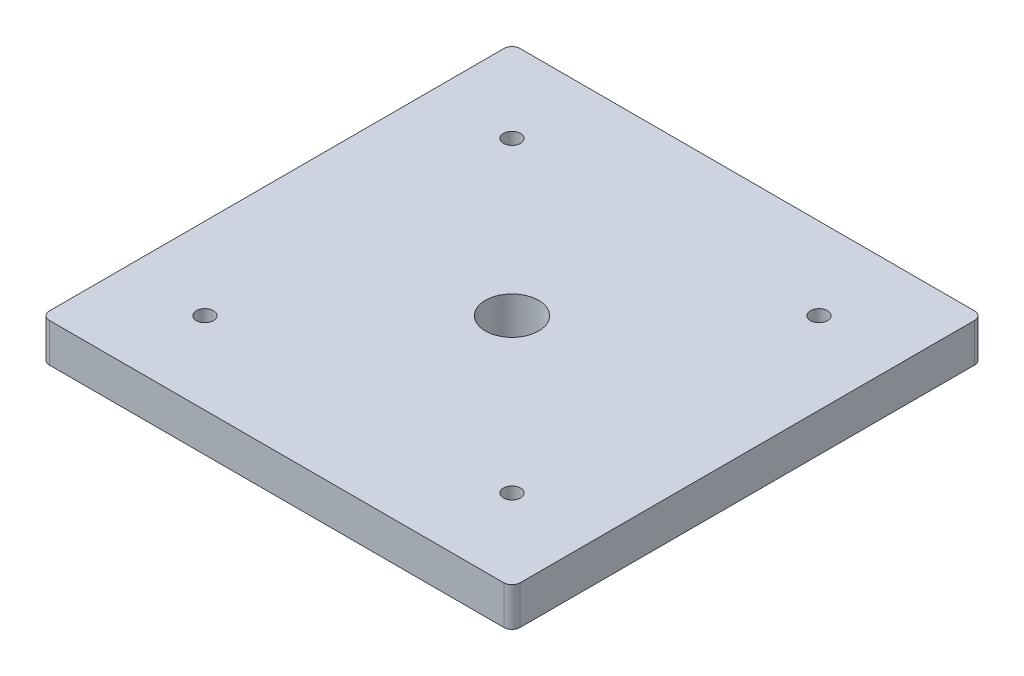
ISO-10303-21;
HEADER;
FILE_DESCRIPTION(('STEP AP214'),'2;1');
FILE_NAME('part.step','',(''),(''),'','','');
FILE_SCHEMA(('AUTOMOTIVE_DESIGN { 1 0 10303 214 1 1 1 1 }'));
ENDSEC;
DATA;
#1=APPLICATION_CONTEXT('core data for automotive mechanical design processes');
#2=APPLICATION_PROTOCOL_DEFINITION('international standard','automotive_design',2000,#1);
#3=PRODUCT_CONTEXT('',#1,'mechanical');
#4=PRODUCT('Part','Part','',(#3));
#5=PRODUCT_RELATED_PRODUCT_CATEGORY('part','',(#4));
#6=PRODUCT_DEFINITION_FORMATION('','',#4);
#7=PRODUCT_DEFINITION_CONTEXT('part definition',#1,'design');
#8=PRODUCT_DEFINITION('design','',#6,#7);
#9=PRODUCT_DEFINITION_SHAPE('','',#8);
#10=(LENGTH_UNIT() NAMED_UNIT(*) SI_UNIT(.MILLI.,.METRE.));
#11=(NAMED_UNIT(*) PLANE_ANGLE_UNIT() SI_UNIT($,.RADIAN.));
#12=(NAMED_UNIT(*) SI_UNIT($,.STERADIAN.) SOLID_ANGLE_UNIT());
#13=UNCERTAINTY_MEASURE_WITH_UNIT(LENGTH_MEASURE(1.E-05),#10,'distance_accuracy_value','');
#14=(GEOMETRIC_REPRESENTATION_CONTEXT(3) GLOBAL_UNCERTAINTY_ASSIGNED_CONTEXT((#13)) GLOBAL_UNIT_ASSIGNED_CONTEXT((#10,
#11,#12)) REPRESENTATION_CONTEXT('',''));
#15=CARTESIAN_POINT('',(0.,0.,0.));
#16=DIRECTION('',(0.,0.,1.));
#17=DIRECTION('',(1.,0.,0.));
#18=AXIS2_PLACEMENT_3D('',#15,#16,#17);
#19=CARTESIAN_POINT('',(-47.6250000000001,5.460000002,-47.6250000000001));
#20=DIRECTION('',(0.,-1.,0.));
#21=DIRECTION('',(0.,0.,-1.));
#22=AXIS2_PLACEMENT_3D('',#19,#20,#21);
#23=CYLINDRICAL_SURFACE('',#22,7.9375);
#24=CARTESIAN_POINT('',(-47.6250000000001,5.460000002,-47.6250000000001));
#25=DIRECTION('',(0.,-1.,0.));
#26=DIRECTION('',(0.,0.,-1.));
#27=AXIS2_PLACEMENT_3D('',#24,#25,#26);
#28=CIRCLE('',#27,7.9375);
#29=CARTESIAN_POINT('',(-47.6250000000001,5.460000002,-55.5625000000001));
#30=VERTEX_POINT('',#29);
#31=EDGE_CURVE('E179',#30,#30,#28,.T.);
#32=ORIENTED_EDGE('',*,*,#31,.F.);
#33=EDGE_LOOP('',(#32));
#34=FACE_BOUND('',#33,.T.);
#35=CARTESIAN_POINT('',(-47.6250000000001,0.,-47.6250000000001));
#36=DIRECTION('',(0.,-1.,0.));
#37=DIRECTION('',(0.,0.,-1.));
#38=AXIS2_PLACEMENT_3D('',#35,#36,#37);
#39=CIRCLE('',#38,7.9375);
#40=CARTESIAN_POINT('',(-47.6250000000001,0.,-55.5625000000001));
#41=VERTEX_POINT('',#40);
#42=EDGE_CURVE('E176',#41,#41,#39,.T.);
#43=ORIENTED_EDGE('',*,*,#42,.T.);
#44=EDGE_LOOP('',(#43));
#45=FACE_BOUND('',#44,.T.);
#46=ADVANCED_FACE('F16',(#34,#45),#23,.F.);
#47=CARTESIAN_POINT('',(47.6249999999999,5.460000002,-47.6250000000001));
#48=DIRECTION('',(0.,-1.,0.));
#49=DIRECTION('',(0.,0.,-1.));
#50=AXIS2_PLACEMENT_3D('',#47,#48,#49);
#51=CYLINDRICAL_SURFACE('',#50,7.9375);
#52=CARTESIAN_POINT('',(47.6249999999999,5.460000002,-47.6250000000001));
#53=DIRECTION('',(0.,-1.,0.));
#54=DIRECTION('',(0.,0.,-1.));
#55=AXIS2_PLACEMENT_3D('',#52,#53,#54);
#56=CIRCLE('',#55,7.9375);
#57=CARTESIAN_POINT('',(47.6249999999999,5.460000002,-55.5625000000001));
#58=VERTEX_POINT('',#57);
#59=EDGE_CURVE('E182',#58,#58,#56,.T.);
#60=ORIENTED_EDGE('',*,*,#59,.F.);
#61=EDGE_LOOP('',(#60));
#62=FACE_BOUND('',#61,.T.);
#63=CARTESIAN_POINT('',(47.6249999999999,0.,-47.6250000000001));
#64=DIRECTION('',(0.,-1.,0.));
#65=DIRECTION('',(0.,0.,-1.));
#66=AXIS2_PLACEMENT_3D('',#63,#64,#65);
#67=CIRCLE('',#66,7.9375);
#68=CARTESIAN_POINT('',(47.6249999999999,0.,-55.5625000000001));
#69=VERTEX_POINT('',#68);
#70=EDGE_CURVE('E173',#69,#69,#67,.T.);
#71=ORIENTED_EDGE('',*,*,#70,.T.);
#72=EDGE_LOOP('',(#71));
#73=FACE_BOUND('',#72,.T.);
#74=ADVANCED_FACE('F212',(#62,#73),#51,.F.);
#75=CARTESIAN_POINT('',(47.625,5.460000002,47.6249999999999));
#76=DIRECTION('',(0.,-1.,0.));
#77=DIRECTION('',(0.,0.,-1.));
#78=AXIS2_PLACEMENT_3D('',#75,#76,#77);
#79=CYLINDRICAL_SURFACE('',#78,7.9375);
#80=CARTESIAN_POINT('',(47.625,5.460000002,47.6249999999999));
#81=DIRECTION('',(0.,-1.,0.));
#82=DIRECTION('',(0.,0.,-1.));
#83=AXIS2_PLACEMENT_3D('',#80,#81,#82);
#84=CIRCLE('',#83,7.9375);
#85=CARTESIAN_POINT('',(47.625,5.460000002,39.6874999999999));
#86=VERTEX_POINT('',#85);
#87=EDGE_CURVE('E184',#86,#86,#84,.T.);
#88=ORIENTED_EDGE('',*,*,#87,.F.);
#89=EDGE_LOOP('',(#88));
#90=FACE_BOUND('',#89,.T.);
#91=CARTESIAN_POINT('',(47.625,0.,47.6249999999999));
#92=DIRECTION('',(0.,-1.,0.));
#93=DIRECTION('',(0.,0.,-1.));
#94=AXIS2_PLACEMENT_3D('',#91,#92,#93);
#95=CIRCLE('',#94,7.9375);
#96=CARTESIAN_POINT('',(47.625,0.,39.6874999999999));
#97=VERTEX_POINT('',#96);
#98=EDGE_CURVE('E170',#97,#97,#95,.T.);
#99=ORIENTED_EDGE('',*,*,#98,.T.);
#100=EDGE_LOOP('',(#99));
#101=FACE_BOUND('',#100,.T.);
#102=ADVANCED_FACE('F196',(#90,#101),#79,.F.);
#103=CARTESIAN_POINT('',(-47.625,5.460000002,47.6249999999999));
#104=DIRECTION('',(0.,-1.,0.));
#105=DIRECTION('',(0.,0.,-1.));
#106=AXIS2_PLACEMENT_3D('',#103,#104,#105);
#107=CYLINDRICAL_SURFACE('',#106,7.9375);
#108=CARTESIAN_POINT('',(-47.625,5.460000002,47.6249999999999));
#109=DIRECTION('',(0.,-1.,0.));
#110=DIRECTION('',(0.,0.,-1.));
#111=AXIS2_PLACEMENT_3D('',#108,#109,#110);
#112=CIRCLE('',#111,7.9375);
#113=CARTESIAN_POINT('',(-47.625,5.460000002,39.6874999999999));
#114=VERTEX_POINT('',#113);
#115=EDGE_CURVE('E19',#114,#114,#112,.T.);
#116=ORIENTED_EDGE('',*,*,#115,.F.);
#117=EDGE_LOOP('',(#116));
#118=FACE_BOUND('',#117,.T.);
#119=CARTESIAN_POINT('',(-47.625,0.,47.6249999999999));
#120=DIRECTION('',(0.,-1.,0.));
#121=DIRECTION('',(0.,0.,-1.));
#122=AXIS2_PLACEMENT_3D('',#119,#120,#121);
#123=CIRCLE('',#122,7.9375);
#124=CARTESIAN_POINT('',(-47.625,0.,39.6874999999999));
#125=VERTEX_POINT('',#124);
#126=EDGE_CURVE('E167',#125,#125,#123,.T.);
#127=ORIENTED_EDGE('',*,*,#126,.T.);
#128=EDGE_LOOP('',(#127));
#129=FACE_BOUND('',#128,.T.);
#130=ADVANCED_FACE('F193',(#118,#129),#107,.F.);
#131=CARTESIAN_POINT('',(-47.625,5.460000002,47.6249999999999));
#132=DIRECTION('',(0.,-1.,0.));
#133=DIRECTION('',(0.,0.,-1.));
#134=AXIS2_PLACEMENT_3D('',#131,#132,#133);
#135=PLANE('',#134);
#136=CARTESIAN_POINT('',(-47.625,5.460000002,47.6249999999999));
#137=DIRECTION('',(0.,-1.,0.));
#138=DIRECTION('',(0.,0.,-1.));
#139=AXIS2_PLACEMENT_3D('',#136,#137,#138);
#140=CIRCLE('',#139,2.667);
#141=CARTESIAN_POINT('',(-47.625,5.460000002,44.9579999999999));
#142=VERTEX_POINT('',#141);
#143=EDGE_CURVE('E164',#142,#142,#140,.F.);
#144=ORIENTED_EDGE('',*,*,#143,.T.);
#145=EDGE_LOOP('',(#144));
#146=FACE_BOUND('',#145,.T.);
#147=ORIENTED_EDGE('',*,*,#115,.T.);
#148=EDGE_LOOP('',(#147));
#149=FACE_BOUND('',#148,.T.);
#150=ADVANCED_FACE('F191',(#146,#149),#135,.T.);
#151=CARTESIAN_POINT('',(47.625,5.460000002,47.6249999999999));
#152=DIRECTION('',(0.,-1.,0.));
#153=DIRECTION('',(0.,0.,-1.));
#154=AXIS2_PLACEMENT_3D('',#151,#152,#153);
#155=PLANE('',#154);
#156=CARTESIAN_POINT('',(47.625,5.460000002,47.6249999999999));
#157=DIRECTION('',(0.,-1.,0.));
#158=DIRECTION('',(0.,0.,-1.));
#159=AXIS2_PLACEMENT_3D('',#156,#157,#158);
#160=CIRCLE('',#159,2.667);
#161=CARTESIAN_POINT('',(47.625,5.460000002,44.9579999999999));
#162=VERTEX_POINT('',#161);
#163=EDGE_CURVE('E161',#162,#162,#160,.F.);
#164=ORIENTED_EDGE('',*,*,#163,.T.);
#165=EDGE_LOOP('',(#164));
#166=FACE_BOUND('',#165,.T.);
#167=ORIENTED_EDGE('',*,*,#87,.T.);
#168=EDGE_LOOP('',(#167));
#169=FACE_BOUND('',#168,.T.);
#170=ADVANCED_FACE('F280',(#166,#169),#155,.T.);
#171=CARTESIAN_POINT('',(47.6249999999999,5.460000002,-47.6250000000001));
#172=DIRECTION('',(0.,-1.,0.));
#173=DIRECTION('',(0.,0.,-1.));
#174=AXIS2_PLACEMENT_3D('',#171,#172,#173);
#175=PLANE('',#174);
#176=CARTESIAN_POINT('',(47.6249999999999,5.460000002,-47.6250000000001));
#177=DIRECTION('',(0.,-1.,0.));
#178=DIRECTION('',(0.,0.,-1.));
#179=AXIS2_PLACEMENT_3D('',#176,#177,#178);
#180=CIRCLE('',#179,2.667);
#181=CARTESIAN_POINT('',(47.6249999999999,5.460000002,-50.2920000000001));
#182=VERTEX_POINT('',#181);
#183=EDGE_CURVE('E158',#182,#182,#180,.F.);
#184=ORIENTED_EDGE('',*,*,#183,.T.);
#185=EDGE_LOOP('',(#184));
#186=FACE_BOUND('',#185,.T.);
#187=ORIENTED_EDGE('',*,*,#59,.T.);
#188=EDGE_LOOP('',(#187));
#189=FACE_BOUND('',#188,.T.);
#190=ADVANCED_FACE('F276',(#186,#189),#175,.T.);
#191=CARTESIAN_POINT('',(-47.6250000000001,5.460000002,-47.6250000000001));
#192=DIRECTION('',(0.,-1.,0.));
#193=DIRECTION('',(0.,0.,-1.));
#194=AXIS2_PLACEMENT_3D('',#191,#192,#193);
#195=PLANE('',#194);
#196=CARTESIAN_POINT('',(-47.6250000000001,5.460000002,-47.6250000000001));
#197=DIRECTION('',(0.,-1.,0.));
#198=DIRECTION('',(0.,0.,-1.));
#199=AXIS2_PLACEMENT_3D('',#196,#197,#198);
#200=CIRCLE('',#199,2.667);
#201=CARTESIAN_POINT('',(-47.6250000000001,5.460000002,-50.2920000000001));
#202=VERTEX_POINT('',#201);
#203=EDGE_CURVE('E112',#202,#202,#200,.F.);
#204=ORIENTED_EDGE('',*,*,#203,.T.);
#205=EDGE_LOOP('',(#204));
#206=FACE_BOUND('',#205,.T.);
#207=ORIENTED_EDGE('',*,*,#31,.T.);
#208=EDGE_LOOP('',(#207));
#209=FACE_BOUND('',#208,.T.);
#210=ADVANCED_FACE('F202',(#206,#209),#195,.T.);
#211=CARTESIAN_POINT('',(0.,0.,0.));
#212=DIRECTION('',(0.,1.,0.));
#213=DIRECTION('',(0.,0.,1.));
#214=AXIS2_PLACEMENT_3D('',#211,#212,#213);
#215=PLANE('',#214);
#216=CARTESIAN_POINT('',(0.,0.,0.));
#217=DIRECTION('',(0.,-1.,0.));
#218=DIRECTION('',(0.,0.,-1.));
#219=AXIS2_PLACEMENT_3D('',#216,#217,#218);
#220=CIRCLE('',#219,8.255);
#221=CARTESIAN_POINT('',(0.,0.,-8.255));
#222=VERTEX_POINT('',#221);
#223=EDGE_CURVE('E145',#222,#222,#220,.F.);
#224=ORIENTED_EDGE('',*,*,#223,.T.);
#225=EDGE_LOOP('',(#224));
#226=FACE_BOUND('',#225,.T.);
#227=CARTESIAN_POINT('',(-70.485,0.,-70.485));
#228=DIRECTION('',(0.,-1.,0.));
#229=DIRECTION('',(0.,0.,-1.));
#230=AXIS2_PLACEMENT_3D('',#227,#228,#229);
#231=CIRCLE('',#230,2.54);
#232=CARTESIAN_POINT('',(-70.485,0.,-73.025));
#233=VERTEX_POINT('',#232);
#234=CARTESIAN_POINT('',(-73.025,0.,-70.485));
#235=VERTEX_POINT('',#234);
#236=EDGE_CURVE('E86',#233,#235,#231,.F.);
#237=ORIENTED_EDGE('',*,*,#236,.F.);
#238=DIRECTION('',(1.,0.,0.));
#239=VECTOR('',#238,1.);
#240=CARTESIAN_POINT('',(73.025,0.,-73.025));
#241=LINE('',#240,#239);
#242=CARTESIAN_POINT('',(70.485,0.,-73.025));
#243=VERTEX_POINT('',#242);
#244=EDGE_CURVE('E77',#233,#243,#241,.T.);
#245=ORIENTED_EDGE('',*,*,#244,.T.);
#246=CARTESIAN_POINT('',(70.485,0.,-70.485));
#247=DIRECTION('',(0.,-1.,0.));
#248=DIRECTION('',(0.,0.,-1.));
#249=AXIS2_PLACEMENT_3D('',#246,#247,#248);
#250=CIRCLE('',#249,2.54);
#251=CARTESIAN_POINT('',(73.025,0.,-70.485));
#252=VERTEX_POINT('',#251);
#253=EDGE_CURVE('E149',#252,#243,#250,.F.);
#254=ORIENTED_EDGE('',*,*,#253,.F.);
#255=DIRECTION('',(0.,0.,1.));
#256=VECTOR('',#255,1.);
#257=CARTESIAN_POINT('',(73.025,0.,73.025));
#258=LINE('',#257,#256);
#259=CARTESIAN_POINT('',(73.025,0.,70.485));
#260=VERTEX_POINT('',#259);
#261=EDGE_CURVE('E113',#252,#260,#258,.T.);
#262=ORIENTED_EDGE('',*,*,#261,.T.);
#263=CARTESIAN_POINT('',(70.485,0.,70.485));
#264=DIRECTION('',(0.,-1.,0.));
#265=DIRECTION('',(0.,0.,-1.));
#266=AXIS2_PLACEMENT_3D('',#263,#264,#265);
#267=CIRCLE('',#266,2.54);
#268=CARTESIAN_POINT('',(70.485,0.,73.025));
#269=VERTEX_POINT('',#268);
#270=EDGE_CURVE('E152',#269,#260,#267,.F.);
#271=ORIENTED_EDGE('',*,*,#270,.F.);
#272=DIRECTION('',(-1.,0.,0.));
#273=VECTOR('',#272,1.);
#274=CARTESIAN_POINT('',(73.025,0.,73.025));
#275=LINE('',#274,#273);
#276=CARTESIAN_POINT('',(-70.485,0.,73.025));
#277=VERTEX_POINT('',#276);
#278=EDGE_CURVE('E117',#269,#277,#275,.T.);
#279=ORIENTED_EDGE('',*,*,#278,.T.);
#280=CARTESIAN_POINT('',(-70.485,0.,70.485));
#281=DIRECTION('',(0.,-1.,0.));
#282=DIRECTION('',(0.,0.,-1.));
#283=AXIS2_PLACEMENT_3D('',#280,#281,#282);
#284=CIRCLE('',#283,2.54);
#285=CARTESIAN_POINT('',(-73.025,0.,70.485));
#286=VERTEX_POINT('',#285);
#287=EDGE_CURVE('E89',#286,#277,#284,.F.);
#288=ORIENTED_EDGE('',*,*,#287,.F.);
#289=DIRECTION('',(0.,0.,-1.));
#290=VECTOR('',#289,1.);
#291=CARTESIAN_POINT('',(-73.025,0.,73.025));
#292=LINE('',#291,#290);
#293=EDGE_CURVE('E82',#286,#235,#292,.T.);
#294=ORIENTED_EDGE('',*,*,#293,.T.);
#295=EDGE_LOOP('',(#237,#245,#254,#262,#271,#279,#288,#294));
#296=FACE_BOUND('',#295,.T.);
#297=ORIENTED_EDGE('',*,*,#126,.F.);
#298=EDGE_LOOP('',(#297));
#299=FACE_BOUND('',#298,.T.);
#300=ORIENTED_EDGE('',*,*,#98,.F.);
#301=EDGE_LOOP('',(#300));
#302=FACE_BOUND('',#301,.T.);
#303=ORIENTED_EDGE('',*,*,#70,.F.);
#304=EDGE_LOOP('',(#303));
#305=FACE_BOUND('',#304,.T.);
#306=ORIENTED_EDGE('',*,*,#42,.F.);
#307=EDGE_LOOP('',(#306));
#308=FACE_BOUND('',#307,.T.);
#309=ADVANCED_FACE('F84',(#226,#296,#299,#302,#305,#308),#215,.F.);
#310=CARTESIAN_POINT('',(-47.625,12.,47.6249999999999));
#311=DIRECTION('',(0.,-1.,0.));
#312=DIRECTION('',(0.,0.,-1.));
#313=AXIS2_PLACEMENT_3D('',#310,#311,#312);
#314=CYLINDRICAL_SURFACE('',#313,2.667);
#315=ORIENTED_EDGE('',*,*,#143,.F.);
#316=EDGE_LOOP('',(#315));
#317=FACE_BOUND('',#316,.T.);
#318=CARTESIAN_POINT('',(-47.625,12.,47.6249999999999));
#319=DIRECTION('',(0.,-1.,0.));
#320=DIRECTION('',(0.,0.,-1.));
#321=AXIS2_PLACEMENT_3D('',#318,#319,#320);
#322=CIRCLE('',#321,2.667);
#323=CARTESIAN_POINT('',(-47.625,12.,44.9579999999999));
#324=VERTEX_POINT('',#323);
#325=EDGE_CURVE('E142',#324,#324,#322,.T.);
#326=ORIENTED_EDGE('',*,*,#325,.F.);
#327=EDGE_LOOP('',(#326));
#328=FACE_BOUND('',#327,.T.);
#329=ADVANCED_FACE('F201',(#317,#328),#314,.F.);
#330=CARTESIAN_POINT('',(47.625,12.,47.6249999999999));
#331=DIRECTION('',(0.,-1.,0.));
#332=DIRECTION('',(0.,0.,-1.));
#333=AXIS2_PLACEMENT_3D('',#330,#331,#332);
#334=CYLINDRICAL_SURFACE('',#333,2.667);
#335=ORIENTED_EDGE('',*,*,#163,.F.);
#336=EDGE_LOOP('',(#335));
#337=FACE_BOUND('',#336,.T.);
#338=CARTESIAN_POINT('',(47.625,12.,47.6249999999999));
#339=DIRECTION('',(0.,-1.,0.));
#340=DIRECTION('',(0.,0.,-1.));
#341=AXIS2_PLACEMENT_3D('',#338,#339,#340);
#342=CIRCLE('',#341,2.667);
#343=CARTESIAN_POINT('',(47.625,12.,44.9579999999999));
#344=VERTEX_POINT('',#343);
#345=EDGE_CURVE('E139',#344,#344,#342,.T.);
#346=ORIENTED_EDGE('',*,*,#345,.F.);
#347=EDGE_LOOP('',(#346));
#348=FACE_BOUND('',#347,.T.);
#349=ADVANCED_FACE('F266',(#337,#348),#334,.F.);
#350=CARTESIAN_POINT('',(47.6249999999999,12.,-47.6250000000001));
#351=DIRECTION('',(0.,-1.,0.));
#352=DIRECTION('',(0.,0.,-1.));
#353=AXIS2_PLACEMENT_3D('',#350,#351,#352);
#354=CYLINDRICAL_SURFACE('',#353,2.667);
#355=ORIENTED_EDGE('',*,*,#183,.F.);
#356=EDGE_LOOP('',(#355));
#357=FACE_BOUND('',#356,.T.);
#358=CARTESIAN_POINT('',(47.6249999999999,12.,-47.6250000000001));
#359=DIRECTION('',(0.,-1.,0.));
#360=DIRECTION('',(0.,0.,-1.));
#361=AXIS2_PLACEMENT_3D('',#358,#359,#360);
#362=CIRCLE('',#361,2.667);
#363=CARTESIAN_POINT('',(47.6249999999999,12.,-50.2920000000001));
#364=VERTEX_POINT('',#363);
#365=EDGE_CURVE('E136',#364,#364,#362,.T.);
#366=ORIENTED_EDGE('',*,*,#365,.F.);
#367=EDGE_LOOP('',(#366));
#368=FACE_BOUND('',#367,.T.);
#369=ADVANCED_FACE('F262',(#357,#368),#354,.F.);
#370=CARTESIAN_POINT('',(-47.6250000000001,12.,-47.6250000000001));
#371=DIRECTION('',(0.,-1.,0.));
#372=DIRECTION('',(0.,0.,-1.));
#373=AXIS2_PLACEMENT_3D('',#370,#371,#372);
#374=CYLINDRICAL_SURFACE('',#373,2.667);
#375=ORIENTED_EDGE('',*,*,#203,.F.);
#376=EDGE_LOOP('',(#375));
#377=FACE_BOUND('',#376,.T.);
#378=CARTESIAN_POINT('',(-47.6250000000001,12.,-47.6250000000001));
#379=DIRECTION('',(0.,-1.,0.));
#380=DIRECTION('',(0.,0.,-1.));
#381=AXIS2_PLACEMENT_3D('',#378,#379,#380);
#382=CIRCLE('',#381,2.667);
#383=CARTESIAN_POINT('',(-47.6250000000001,12.,-50.2920000000001));
#384=VERTEX_POINT('',#383);
#385=EDGE_CURVE('E133',#384,#384,#382,.T.);
#386=ORIENTED_EDGE('',*,*,#385,.F.);
#387=EDGE_LOOP('',(#386));
#388=FACE_BOUND('',#387,.T.);
#389=ADVANCED_FACE('F259',(#377,#388),#374,.F.);
#390=CARTESIAN_POINT('',(73.025,12.,-73.025));
#391=DIRECTION('',(0.,0.,1.));
#392=DIRECTION('',(1.,0.,0.));
#393=AXIS2_PLACEMENT_3D('',#390,#391,#392);
#394=PLANE('',#393);
#395=DIRECTION('',(0.,-1.,0.));
#396=VECTOR('',#395,1.);
#397=CARTESIAN_POINT('',(-70.485,12.,-73.025));
#398=LINE('',#397,#396);
#399=CARTESIAN_POINT('',(-70.485,12.,-73.025));
#400=VERTEX_POINT('',#399);
#401=EDGE_CURVE('E99',#400,#233,#398,.T.);
#402=ORIENTED_EDGE('',*,*,#401,.F.);
#403=DIRECTION('',(1.,0.,0.));
#404=VECTOR('',#403,1.);
#405=CARTESIAN_POINT('',(0.,12.,-73.025));
#406=LINE('',#405,#404);
#407=CARTESIAN_POINT('',(70.485,12.,-73.025));
#408=VERTEX_POINT('',#407);
#409=EDGE_CURVE('E132',#408,#400,#406,.F.);
#410=ORIENTED_EDGE('',*,*,#409,.F.);
#411=DIRECTION('',(0.,-1.,0.));
#412=VECTOR('',#411,1.);
#413=CARTESIAN_POINT('',(70.485,12.,-73.025));
#414=LINE('',#413,#412);
#415=EDGE_CURVE('E148',#243,#408,#414,.F.);
#416=ORIENTED_EDGE('',*,*,#415,.F.);
#417=ORIENTED_EDGE('',*,*,#244,.F.);
#418=EDGE_LOOP('',(#402,#410,#416,#417));
#419=FACE_BOUND('',#418,.T.);
#420=ADVANCED_FACE('F256',(#419),#394,.F.);
#421=CARTESIAN_POINT('',(-70.485,12.,-70.485));
#422=DIRECTION('',(0.,-1.,0.));
#423=DIRECTION('',(0.,0.,-1.));
#424=AXIS2_PLACEMENT_3D('',#421,#422,#423);
#425=CYLINDRICAL_SURFACE('',#424,2.54);
#426=ORIENTED_EDGE('',*,*,#236,.T.);
#427=DIRECTION('',(0.,1.,0.));
#428=VECTOR('',#427,1.);
#429=CARTESIAN_POINT('',(-73.025,12.,-70.485));
#430=LINE('',#429,#428);
#431=CARTESIAN_POINT('',(-73.025,12.,-70.485));
#432=VERTEX_POINT('',#431);
#433=EDGE_CURVE('E93',#235,#432,#430,.T.);
#434=ORIENTED_EDGE('',*,*,#433,.T.);
#435=CARTESIAN_POINT('',(-70.485,12.,-70.485));
#436=DIRECTION('',(0.,-1.,0.));
#437=DIRECTION('',(0.,0.,-1.));
#438=AXIS2_PLACEMENT_3D('',#435,#436,#437);
#439=CIRCLE('',#438,2.54);
#440=EDGE_CURVE('E130',#400,#432,#439,.F.);
#441=ORIENTED_EDGE('',*,*,#440,.F.);
#442=ORIENTED_EDGE('',*,*,#401,.T.);
#443=EDGE_LOOP('',(#426,#434,#441,#442));
#444=FACE_BOUND('',#443,.T.);
#445=ADVANCED_FACE('F96',(#444),#425,.T.);
#446=CARTESIAN_POINT('',(-73.025,12.,73.025));
#447=DIRECTION('',(1.,0.,0.));
#448=DIRECTION('',(0.,0.,-1.));
#449=AXIS2_PLACEMENT_3D('',#446,#447,#448);
#450=PLANE('',#449);
#451=ORIENTED_EDGE('',*,*,#433,.F.);
#452=ORIENTED_EDGE('',*,*,#293,.F.);
#453=DIRECTION('',(0.,-1.,0.));
#454=VECTOR('',#453,1.);
#455=CARTESIAN_POINT('',(-73.025,12.,70.485));
#456=LINE('',#455,#454);
#457=CARTESIAN_POINT('',(-73.025,12.,70.485));
#458=VERTEX_POINT('',#457);
#459=EDGE_CURVE('E105',#458,#286,#456,.T.);
#460=ORIENTED_EDGE('',*,*,#459,.F.);
#461=DIRECTION('',(0.,0.,1.));
#462=VECTOR('',#461,1.);
#463=CARTESIAN_POINT('',(-73.025,12.,0.));
#464=LINE('',#463,#462);
#465=EDGE_CURVE('E103',#432,#458,#464,.T.);
#466=ORIENTED_EDGE('',*,*,#465,.F.);
#467=EDGE_LOOP('',(#451,#452,#460,#466));
#468=FACE_BOUND('',#467,.T.);
#469=ADVANCED_FACE('F101',(#468),#450,.F.);
#470=CARTESIAN_POINT('',(-70.485,12.,70.485));
#471=DIRECTION('',(0.,-1.,0.));
#472=DIRECTION('',(0.,0.,-1.));
#473=AXIS2_PLACEMENT_3D('',#470,#471,#472);
#474=CYLINDRICAL_SURFACE('',#473,2.54);
#475=ORIENTED_EDGE('',*,*,#287,.T.);
#476=DIRECTION('',(0.,1.,0.));
#477=VECTOR('',#476,1.);
#478=CARTESIAN_POINT('',(-70.485,12.,73.025));
#479=LINE('',#478,#477);
#480=CARTESIAN_POINT('',(-70.485,12.,73.025));
#481=VERTEX_POINT('',#480);
#482=EDGE_CURVE('E118',#277,#481,#479,.T.);
#483=ORIENTED_EDGE('',*,*,#482,.T.);
#484=CARTESIAN_POINT('',(-70.485,12.,70.485));
#485=DIRECTION('',(0.,-1.,0.));
#486=DIRECTION('',(0.,0.,-1.));
#487=AXIS2_PLACEMENT_3D('',#484,#485,#486);
#488=CIRCLE('',#487,2.54);
#489=EDGE_CURVE('E127',#458,#481,#488,.F.);
#490=ORIENTED_EDGE('',*,*,#489,.F.);
#491=ORIENTED_EDGE('',*,*,#459,.T.);
#492=EDGE_LOOP('',(#475,#483,#490,#491));
#493=FACE_BOUND('',#492,.T.);
#494=ADVANCED_FACE('F247',(#493),#474,.T.);
#495=CARTESIAN_POINT('',(73.025,12.,73.025));
#496=DIRECTION('',(0.,0.,-1.));
#497=DIRECTION('',(-1.,0.,0.));
#498=AXIS2_PLACEMENT_3D('',#495,#496,#497);
#499=PLANE('',#498);
#500=ORIENTED_EDGE('',*,*,#482,.F.);
#501=ORIENTED_EDGE('',*,*,#278,.F.);
#502=DIRECTION('',(0.,-1.,0.));
#503=VECTOR('',#502,1.);
#504=CARTESIAN_POINT('',(70.485,12.,73.025));
#505=LINE('',#504,#503);
#506=CARTESIAN_POINT('',(70.485,12.,73.025));
#507=VERTEX_POINT('',#506);
#508=EDGE_CURVE('E154',#507,#269,#505,.T.);
#509=ORIENTED_EDGE('',*,*,#508,.F.);
#510=DIRECTION('',(1.,0.,0.));
#511=VECTOR('',#510,1.);
#512=CARTESIAN_POINT('',(0.,12.,73.025));
#513=LINE('',#512,#511);
#514=EDGE_CURVE('E126',#481,#507,#513,.T.);
#515=ORIENTED_EDGE('',*,*,#514,.F.);
#516=EDGE_LOOP('',(#500,#501,#509,#515));
#517=FACE_BOUND('',#516,.T.);
#518=ADVANCED_FACE('F243',(#517),#499,.F.);
#519=CARTESIAN_POINT('',(70.485,12.,70.485));
#520=DIRECTION('',(0.,-1.,0.));
#521=DIRECTION('',(0.,0.,-1.));
#522=AXIS2_PLACEMENT_3D('',#519,#520,#521);
#523=CYLINDRICAL_SURFACE('',#522,2.54);
#524=ORIENTED_EDGE('',*,*,#270,.T.);
#525=DIRECTION('',(0.,1.,0.));
#526=VECTOR('',#525,1.);
#527=CARTESIAN_POINT('',(73.025,12.,70.485));
#528=LINE('',#527,#526);
#529=CARTESIAN_POINT('',(73.025,12.,70.485));
#530=VERTEX_POINT('',#529);
#531=EDGE_CURVE('E116',#260,#530,#528,.T.);
#532=ORIENTED_EDGE('',*,*,#531,.T.);
#533=CARTESIAN_POINT('',(70.485,12.,70.485));
#534=DIRECTION('',(0.,-1.,0.));
#535=DIRECTION('',(0.,0.,-1.));
#536=AXIS2_PLACEMENT_3D('',#533,#534,#535);
#537=CIRCLE('',#536,2.54);
#538=EDGE_CURVE('E123',#507,#530,#537,.F.);
#539=ORIENTED_EDGE('',*,*,#538,.F.);
#540=ORIENTED_EDGE('',*,*,#508,.T.);
#541=EDGE_LOOP('',(#524,#532,#539,#540));
#542=FACE_BOUND('',#541,.T.);
#543=ADVANCED_FACE('F240',(#542),#523,.T.);
#544=CARTESIAN_POINT('',(73.025,12.,73.025));
#545=DIRECTION('',(-1.,0.,0.));
#546=DIRECTION('',(0.,0.,1.));
#547=AXIS2_PLACEMENT_3D('',#544,#545,#546);
#548=PLANE('',#547);
#549=DIRECTION('',(0.,-1.,0.));
#550=VECTOR('',#549,1.);
#551=CARTESIAN_POINT('',(73.025,12.,-70.485));
#552=LINE('',#551,#550);
#553=CARTESIAN_POINT('',(73.025,12.,-70.485));
#554=VERTEX_POINT('',#553);
#555=EDGE_CURVE('E34',#554,#252,#552,.T.);
#556=ORIENTED_EDGE('',*,*,#555,.F.);
#557=DIRECTION('',(0.,0.,1.));
#558=VECTOR('',#557,1.);
#559=CARTESIAN_POINT('',(73.025,12.,0.));
#560=LINE('',#559,#558);
#561=EDGE_CURVE('E122',#530,#554,#560,.F.);
#562=ORIENTED_EDGE('',*,*,#561,.F.);
#563=ORIENTED_EDGE('',*,*,#531,.F.);
#564=ORIENTED_EDGE('',*,*,#261,.F.);
#565=EDGE_LOOP('',(#556,#562,#563,#564));
#566=FACE_BOUND('',#565,.T.);
#567=ADVANCED_FACE('F236',(#566),#548,.F.);
#568=CARTESIAN_POINT('',(70.485,12.,-70.485));
#569=DIRECTION('',(0.,-1.,0.));
#570=DIRECTION('',(0.,0.,-1.));
#571=AXIS2_PLACEMENT_3D('',#568,#569,#570);
#572=CYLINDRICAL_SURFACE('',#571,2.54);
#573=ORIENTED_EDGE('',*,*,#253,.T.);
#574=ORIENTED_EDGE('',*,*,#415,.T.);
#575=CARTESIAN_POINT('',(70.485,12.,-70.485));
#576=DIRECTION('',(0.,-1.,0.));
#577=DIRECTION('',(0.,0.,-1.));
#578=AXIS2_PLACEMENT_3D('',#575,#576,#577);
#579=CIRCLE('',#578,2.54);
#580=EDGE_CURVE('E25',#554,#408,#579,.F.);
#581=ORIENTED_EDGE('',*,*,#580,.F.);
#582=ORIENTED_EDGE('',*,*,#555,.T.);
#583=EDGE_LOOP('',(#573,#574,#581,#582));
#584=FACE_BOUND('',#583,.T.);
#585=ADVANCED_FACE('F229',(#584),#572,.T.);
#586=CARTESIAN_POINT('',(0.,12.,0.));
#587=DIRECTION('',(0.,-1.,0.));
#588=DIRECTION('',(0.,0.,-1.));
#589=AXIS2_PLACEMENT_3D('',#586,#587,#588);
#590=CYLINDRICAL_SURFACE('',#589,8.255);
#591=CARTESIAN_POINT('',(0.,12.,0.));
#592=DIRECTION('',(0.,-1.,0.));
#593=DIRECTION('',(0.,0.,-1.));
#594=AXIS2_PLACEMENT_3D('',#591,#592,#593);
#595=CIRCLE('',#594,8.255);
#596=CARTESIAN_POINT('',(0.,12.,-8.255));
#597=VERTEX_POINT('',#596);
#598=EDGE_CURVE('E11',#597,#597,#595,.T.);
#599=ORIENTED_EDGE('',*,*,#598,.F.);
#600=EDGE_LOOP('',(#599));
#601=FACE_BOUND('',#600,.T.);
#602=ORIENTED_EDGE('',*,*,#223,.F.);
#603=EDGE_LOOP('',(#602));
#604=FACE_BOUND('',#603,.T.);
#605=ADVANCED_FACE('F222',(#601,#604),#590,.F.);
#606=CARTESIAN_POINT('',(0.,12.,0.));
#607=DIRECTION('',(0.,1.,0.));
#608=DIRECTION('',(0.,0.,1.));
#609=AXIS2_PLACEMENT_3D('',#606,#607,#608);
#610=PLANE('',#609);
#611=ORIENTED_EDGE('',*,*,#598,.T.);
#612=EDGE_LOOP('',(#611));
#613=FACE_BOUND('',#612,.T.);
#614=ORIENTED_EDGE('',*,*,#561,.T.);
#615=ORIENTED_EDGE('',*,*,#580,.T.);
#616=ORIENTED_EDGE('',*,*,#409,.T.);
#617=ORIENTED_EDGE('',*,*,#440,.T.);
#618=ORIENTED_EDGE('',*,*,#465,.T.);
#619=ORIENTED_EDGE('',*,*,#489,.T.);
#620=ORIENTED_EDGE('',*,*,#514,.T.);
#621=ORIENTED_EDGE('',*,*,#538,.T.);
#622=EDGE_LOOP('',(#614,#615,#616,#617,#618,#619,#620,#621));
#623=FACE_BOUND('',#622,.T.);
#624=ORIENTED_EDGE('',*,*,#385,.T.);
#625=EDGE_LOOP('',(#624));
#626=FACE_BOUND('',#625,.T.);
#627=ORIENTED_EDGE('',*,*,#365,.T.);
#628=EDGE_LOOP('',(#627));
#629=FACE_BOUND('',#628,.T.);
#630=ORIENTED_EDGE('',*,*,#345,.T.);
#631=EDGE_LOOP('',(#630));
#632=FACE_BOUND('',#631,.T.);
#633=ORIENTED_EDGE('',*,*,#325,.T.);
#634=EDGE_LOOP('',(#633));
#635=FACE_BOUND('',#634,.T.);
#636=ADVANCED_FACE('F220',(#613,#623,#626,#629,#632,#635),#610,.T.);
#637=CLOSED_SHELL('',(#46,#74,#102,#130,#150,#170,#190,#210,#309,#329,#349,#369,#389,#420,#445,
#469,#494,#518,#543,#567,#585,#605,#636));
#638=MANIFOLD_SOLID_BREP('B1',#637);
#639=ADVANCED_BREP_SHAPE_REPRESENTATION('',(#18,#638),#14);
#640=SHAPE_DEFINITION_REPRESENTATION(#9,#639);
ENDSEC;
END-ISO-10303-21;
